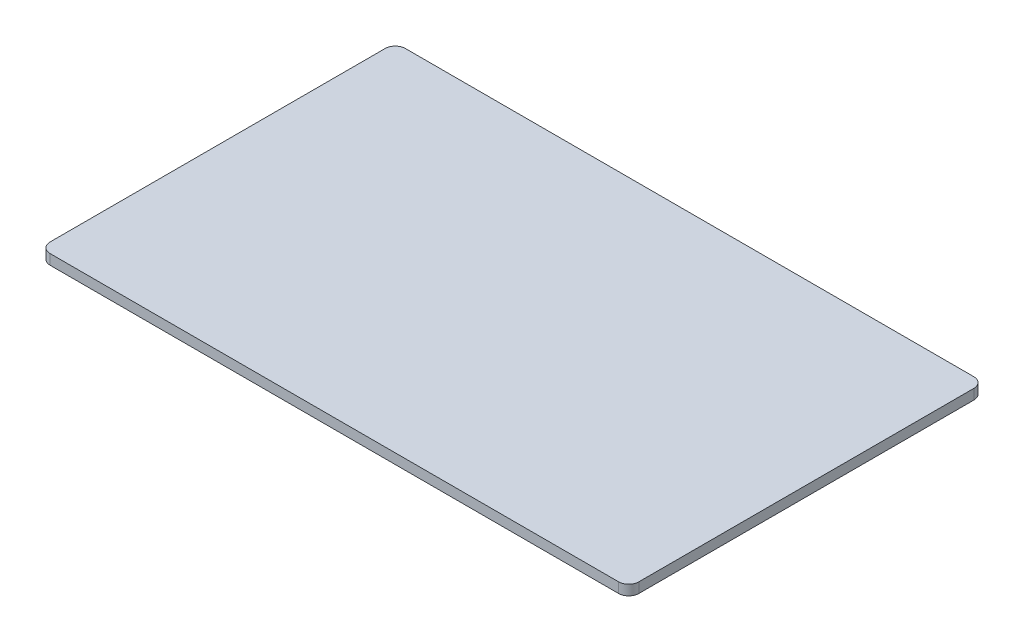
ISO-10303-21;
HEADER;
FILE_DESCRIPTION(('STEP AP214'),'2;1');
FILE_NAME('part.step','',(''),(''),'','','');
FILE_SCHEMA(('AUTOMOTIVE_DESIGN { 1 0 10303 214 1 1 1 1 }'));
ENDSEC;
DATA;
#1=APPLICATION_CONTEXT('core data for automotive mechanical design processes');
#2=APPLICATION_PROTOCOL_DEFINITION('international standard','automotive_design',2000,#1);
#3=PRODUCT_CONTEXT('',#1,'mechanical');
#4=PRODUCT('Part','Part','',(#3));
#5=PRODUCT_RELATED_PRODUCT_CATEGORY('part','',(#4));
#6=PRODUCT_DEFINITION_FORMATION('','',#4);
#7=PRODUCT_DEFINITION_CONTEXT('part definition',#1,'design');
#8=PRODUCT_DEFINITION('design','',#6,#7);
#9=PRODUCT_DEFINITION_SHAPE('','',#8);
#10=(LENGTH_UNIT() NAMED_UNIT(*) SI_UNIT(.MILLI.,.METRE.));
#11=(NAMED_UNIT(*) PLANE_ANGLE_UNIT() SI_UNIT($,.RADIAN.));
#12=(NAMED_UNIT(*) SI_UNIT($,.STERADIAN.) SOLID_ANGLE_UNIT());
#13=UNCERTAINTY_MEASURE_WITH_UNIT(LENGTH_MEASURE(1.E-05),#10,'distance_accuracy_value','');
#14=(GEOMETRIC_REPRESENTATION_CONTEXT(3) GLOBAL_UNCERTAINTY_ASSIGNED_CONTEXT((#13)) GLOBAL_UNIT_ASSIGNED_CONTEXT((#10,
#11,#12)) REPRESENTATION_CONTEXT('',''));
#15=CARTESIAN_POINT('',(0.,0.,0.));
#16=DIRECTION('',(0.,0.,1.));
#17=DIRECTION('',(1.,0.,0.));
#18=AXIS2_PLACEMENT_3D('',#15,#16,#17);
#19=CARTESIAN_POINT('',(-73.66,2.54,88.9));
#20=DIRECTION('',(0.,0.,-1.));
#21=DIRECTION('',(-1.,0.,0.));
#22=AXIS2_PLACEMENT_3D('',#19,#20,#21);
#23=PLANE('',#22);
#24=DIRECTION('',(1.,0.,0.));
#25=VECTOR('',#24,1.);
#26=CARTESIAN_POINT('',(-73.66,2.54,88.9));
#27=LINE('',#26,#25);
#28=CARTESIAN_POINT('',(-71.12,2.54,88.9));
#29=VERTEX_POINT('',#28);
#30=CARTESIAN_POINT('',(71.12,2.54,88.9));
#31=VERTEX_POINT('',#30);
#32=EDGE_CURVE('E134',#29,#31,#27,.T.);
#33=ORIENTED_EDGE('',*,*,#32,.F.);
#34=DIRECTION('',(0.,-1.,0.));
#35=VECTOR('',#34,1.);
#36=CARTESIAN_POINT('',(-71.12,0.,88.9));
#37=LINE('',#36,#35);
#38=CARTESIAN_POINT('',(-71.12,0.,88.9));
#39=VERTEX_POINT('',#38);
#40=EDGE_CURVE('E177',#29,#39,#37,.T.);
#41=ORIENTED_EDGE('',*,*,#40,.T.);
#42=DIRECTION('',(1.,0.,0.));
#43=VECTOR('',#42,1.);
#44=CARTESIAN_POINT('',(-73.66,0.,88.9));
#45=LINE('',#44,#43);
#46=CARTESIAN_POINT('',(71.12,0.,88.9));
#47=VERTEX_POINT('',#46);
#48=EDGE_CURVE('E116',#39,#47,#45,.T.);
#49=ORIENTED_EDGE('',*,*,#48,.T.);
#50=DIRECTION('',(0.,-1.,0.));
#51=VECTOR('',#50,1.);
#52=CARTESIAN_POINT('',(71.12,2.54,88.9));
#53=LINE('',#52,#51);
#54=EDGE_CURVE('E174',#47,#31,#53,.F.);
#55=ORIENTED_EDGE('',*,*,#54,.T.);
#56=EDGE_LOOP('',(#33,#41,#49,#55));
#57=FACE_BOUND('',#56,.T.);
#58=ADVANCED_FACE('F44',(#57),#23,.F.);
#59=CARTESIAN_POINT('',(73.66,2.54,0.));
#60=DIRECTION('',(1.,0.,0.));
#61=DIRECTION('',(0.,0.,-1.));
#62=AXIS2_PLACEMENT_3D('',#59,#60,#61);
#63=PLANE('',#62);
#64=DIRECTION('',(0.,0.,1.));
#65=VECTOR('',#64,1.);
#66=CARTESIAN_POINT('',(73.66,2.54,0.));
#67=LINE('',#66,#65);
#68=CARTESIAN_POINT('',(73.66,2.54,2.53999999999997));
#69=VERTEX_POINT('',#68);
#70=CARTESIAN_POINT('',(73.66,2.54,86.36));
#71=VERTEX_POINT('',#70);
#72=EDGE_CURVE('E184',#69,#71,#67,.T.);
#73=ORIENTED_EDGE('',*,*,#72,.T.);
#74=DIRECTION('',(0.,-1.,0.));
#75=VECTOR('',#74,1.);
#76=CARTESIAN_POINT('',(73.66,0.,86.36));
#77=LINE('',#76,#75);
#78=CARTESIAN_POINT('',(73.66,0.,86.36));
#79=VERTEX_POINT('',#78);
#80=EDGE_CURVE('E11',#71,#79,#77,.T.);
#81=ORIENTED_EDGE('',*,*,#80,.T.);
#82=DIRECTION('',(0.,0.,1.));
#83=VECTOR('',#82,1.);
#84=CARTESIAN_POINT('',(73.66,0.,0.));
#85=LINE('',#84,#83);
#86=CARTESIAN_POINT('',(73.66,0.,2.53999999999997));
#87=VERTEX_POINT('',#86);
#88=EDGE_CURVE('E194',#87,#79,#85,.T.);
#89=ORIENTED_EDGE('',*,*,#88,.F.);
#90=DIRECTION('',(0.,-1.,0.));
#91=VECTOR('',#90,1.);
#92=CARTESIAN_POINT('',(73.66,2.54,2.53999999999997));
#93=LINE('',#92,#91);
#94=EDGE_CURVE('E53',#87,#69,#93,.F.);
#95=ORIENTED_EDGE('',*,*,#94,.T.);
#96=EDGE_LOOP('',(#73,#81,#89,#95));
#97=FACE_BOUND('',#96,.T.);
#98=ADVANCED_FACE('F218',(#97),#63,.T.);
#99=CARTESIAN_POINT('',(-73.66,2.54,0.));
#100=DIRECTION('',(0.,0.,-1.));
#101=DIRECTION('',(-1.,0.,0.));
#102=AXIS2_PLACEMENT_3D('',#99,#100,#101);
#103=PLANE('',#102);
#104=DIRECTION('',(1.,0.,0.));
#105=VECTOR('',#104,1.);
#106=CARTESIAN_POINT('',(-73.66,0.,0.));
#107=LINE('',#106,#105);
#108=CARTESIAN_POINT('',(-71.12,0.,0.));
#109=VERTEX_POINT('',#108);
#110=CARTESIAN_POINT('',(71.12,0.,0.));
#111=VERTEX_POINT('',#110);
#112=EDGE_CURVE('E135',#109,#111,#107,.T.);
#113=ORIENTED_EDGE('',*,*,#112,.F.);
#114=DIRECTION('',(0.,-1.,0.));
#115=VECTOR('',#114,1.);
#116=CARTESIAN_POINT('',(-71.12,2.54,0.));
#117=LINE('',#116,#115);
#118=CARTESIAN_POINT('',(-71.12,2.54,0.));
#119=VERTEX_POINT('',#118);
#120=EDGE_CURVE('E161',#109,#119,#117,.F.);
#121=ORIENTED_EDGE('',*,*,#120,.T.);
#122=DIRECTION('',(1.,0.,0.));
#123=VECTOR('',#122,1.);
#124=CARTESIAN_POINT('',(-73.66,2.54,0.));
#125=LINE('',#124,#123);
#126=CARTESIAN_POINT('',(71.12,2.54,0.));
#127=VERTEX_POINT('',#126);
#128=EDGE_CURVE('E147',#119,#127,#125,.T.);
#129=ORIENTED_EDGE('',*,*,#128,.T.);
#130=DIRECTION('',(0.,-1.,0.));
#131=VECTOR('',#130,1.);
#132=CARTESIAN_POINT('',(71.12,2.54,0.));
#133=LINE('',#132,#131);
#134=EDGE_CURVE('E157',#127,#111,#133,.T.);
#135=ORIENTED_EDGE('',*,*,#134,.T.);
#136=EDGE_LOOP('',(#113,#121,#129,#135));
#137=FACE_BOUND('',#136,.T.);
#138=ADVANCED_FACE('F202',(#137),#103,.T.);
#139=CARTESIAN_POINT('',(-73.66,2.54,88.9));
#140=DIRECTION('',(-1.,0.,0.));
#141=DIRECTION('',(0.,0.,1.));
#142=AXIS2_PLACEMENT_3D('',#139,#140,#141);
#143=PLANE('',#142);
#144=DIRECTION('',(0.,0.,-1.));
#145=VECTOR('',#144,1.);
#146=CARTESIAN_POINT('',(-73.66,2.54,88.9));
#147=LINE('',#146,#145);
#148=CARTESIAN_POINT('',(-73.66,2.54,86.36));
#149=VERTEX_POINT('',#148);
#150=CARTESIAN_POINT('',(-73.66,2.54,2.54));
#151=VERTEX_POINT('',#150);
#152=EDGE_CURVE('E141',#149,#151,#147,.T.);
#153=ORIENTED_EDGE('',*,*,#152,.T.);
#154=DIRECTION('',(0.,-1.,0.));
#155=VECTOR('',#154,1.);
#156=CARTESIAN_POINT('',(-73.66,2.54,2.54));
#157=LINE('',#156,#155);
#158=CARTESIAN_POINT('',(-73.66,0.,2.54));
#159=VERTEX_POINT('',#158);
#160=EDGE_CURVE('E132',#151,#159,#157,.T.);
#161=ORIENTED_EDGE('',*,*,#160,.T.);
#162=DIRECTION('',(0.,0.,-1.));
#163=VECTOR('',#162,1.);
#164=CARTESIAN_POINT('',(-73.66,0.,88.9));
#165=LINE('',#164,#163);
#166=CARTESIAN_POINT('',(-73.66,0.,86.36));
#167=VERTEX_POINT('',#166);
#168=EDGE_CURVE('E114',#167,#159,#165,.T.);
#169=ORIENTED_EDGE('',*,*,#168,.F.);
#170=DIRECTION('',(0.,-1.,0.));
#171=VECTOR('',#170,1.);
#172=CARTESIAN_POINT('',(-73.66,2.54,86.36));
#173=LINE('',#172,#171);
#174=EDGE_CURVE('E129',#167,#149,#173,.F.);
#175=ORIENTED_EDGE('',*,*,#174,.T.);
#176=EDGE_LOOP('',(#153,#161,#169,#175));
#177=FACE_BOUND('',#176,.T.);
#178=ADVANCED_FACE('F128',(#177),#143,.T.);
#179=CARTESIAN_POINT('',(0.,2.54,0.));
#180=DIRECTION('',(0.,-1.,0.));
#181=DIRECTION('',(-1.,0.,0.));
#182=AXIS2_PLACEMENT_3D('',#179,#180,#181);
#183=PLANE('',#182);
#184=ORIENTED_EDGE('',*,*,#128,.F.);
#185=CARTESIAN_POINT('',(-71.12,2.54,2.54));
#186=DIRECTION('',(0.,-1.,0.));
#187=DIRECTION('',(0.,0.,-1.));
#188=AXIS2_PLACEMENT_3D('',#185,#186,#187);
#189=CIRCLE('',#188,2.54);
#190=EDGE_CURVE('E171',#119,#151,#189,.F.);
#191=ORIENTED_EDGE('',*,*,#190,.T.);
#192=ORIENTED_EDGE('',*,*,#152,.F.);
#193=CARTESIAN_POINT('',(-71.12,2.54,86.36));
#194=DIRECTION('',(0.,-1.,0.));
#195=DIRECTION('',(0.,0.,-1.));
#196=AXIS2_PLACEMENT_3D('',#193,#194,#195);
#197=CIRCLE('',#196,2.54);
#198=EDGE_CURVE('E139',#149,#29,#197,.F.);
#199=ORIENTED_EDGE('',*,*,#198,.T.);
#200=ORIENTED_EDGE('',*,*,#32,.T.);
#201=CARTESIAN_POINT('',(71.12,2.54,86.36));
#202=DIRECTION('',(0.,-1.,0.));
#203=DIRECTION('',(0.,0.,-1.));
#204=AXIS2_PLACEMENT_3D('',#201,#202,#203);
#205=CIRCLE('',#204,2.54);
#206=EDGE_CURVE('E60',#31,#71,#205,.F.);
#207=ORIENTED_EDGE('',*,*,#206,.T.);
#208=ORIENTED_EDGE('',*,*,#72,.F.);
#209=CARTESIAN_POINT('',(71.12,2.54,2.53999999999997));
#210=DIRECTION('',(0.,-1.,0.));
#211=DIRECTION('',(0.,0.,-1.));
#212=AXIS2_PLACEMENT_3D('',#209,#210,#211);
#213=CIRCLE('',#212,2.54);
#214=EDGE_CURVE('E164',#69,#127,#213,.F.);
#215=ORIENTED_EDGE('',*,*,#214,.T.);
#216=EDGE_LOOP('',(#184,#191,#192,#199,#200,#207,#208,#215));
#217=FACE_BOUND('',#216,.T.);
#218=ADVANCED_FACE('F208',(#217),#183,.F.);
#219=CARTESIAN_POINT('',(0.,0.,0.));
#220=DIRECTION('',(0.,-1.,0.));
#221=DIRECTION('',(-1.,0.,0.));
#222=AXIS2_PLACEMENT_3D('',#219,#220,#221);
#223=PLANE('',#222);
#224=ORIENTED_EDGE('',*,*,#168,.T.);
#225=CARTESIAN_POINT('',(-71.12,0.,2.54));
#226=DIRECTION('',(0.,-1.,0.));
#227=DIRECTION('',(0.,0.,-1.));
#228=AXIS2_PLACEMENT_3D('',#225,#226,#227);
#229=CIRCLE('',#228,2.54);
#230=EDGE_CURVE('E122',#159,#109,#229,.T.);
#231=ORIENTED_EDGE('',*,*,#230,.T.);
#232=ORIENTED_EDGE('',*,*,#112,.T.);
#233=CARTESIAN_POINT('',(71.12,0.,2.53999999999997));
#234=DIRECTION('',(0.,-1.,0.));
#235=DIRECTION('',(0.,0.,-1.));
#236=AXIS2_PLACEMENT_3D('',#233,#234,#235);
#237=CIRCLE('',#236,2.54);
#238=EDGE_CURVE('E145',#111,#87,#237,.T.);
#239=ORIENTED_EDGE('',*,*,#238,.T.);
#240=ORIENTED_EDGE('',*,*,#88,.T.);
#241=CARTESIAN_POINT('',(71.12,0.,86.36));
#242=DIRECTION('',(0.,-1.,0.));
#243=DIRECTION('',(0.,0.,-1.));
#244=AXIS2_PLACEMENT_3D('',#241,#242,#243);
#245=CIRCLE('',#244,2.54);
#246=EDGE_CURVE('E123',#79,#47,#245,.T.);
#247=ORIENTED_EDGE('',*,*,#246,.T.);
#248=ORIENTED_EDGE('',*,*,#48,.F.);
#249=CARTESIAN_POINT('',(-71.12,0.,86.36));
#250=DIRECTION('',(0.,-1.,0.));
#251=DIRECTION('',(0.,0.,-1.));
#252=AXIS2_PLACEMENT_3D('',#249,#250,#251);
#253=CIRCLE('',#252,2.54);
#254=EDGE_CURVE('E111',#39,#167,#253,.T.);
#255=ORIENTED_EDGE('',*,*,#254,.T.);
#256=EDGE_LOOP('',(#224,#231,#232,#239,#240,#247,#248,#255));
#257=FACE_BOUND('',#256,.T.);
#258=ADVANCED_FACE('F113',(#257),#223,.T.);
#259=CARTESIAN_POINT('',(-71.12,2.54,2.54));
#260=DIRECTION('',(0.,-1.,0.));
#261=DIRECTION('',(0.,0.,-1.));
#262=AXIS2_PLACEMENT_3D('',#259,#260,#261);
#263=CYLINDRICAL_SURFACE('',#262,2.54);
#264=ORIENTED_EDGE('',*,*,#190,.F.);
#265=ORIENTED_EDGE('',*,*,#120,.F.);
#266=ORIENTED_EDGE('',*,*,#230,.F.);
#267=ORIENTED_EDGE('',*,*,#160,.F.);
#268=EDGE_LOOP('',(#264,#265,#266,#267));
#269=FACE_BOUND('',#268,.T.);
#270=ADVANCED_FACE('F207',(#269),#263,.T.);
#271=CARTESIAN_POINT('',(-71.12,2.54,86.36));
#272=DIRECTION('',(0.,1.,0.));
#273=DIRECTION('',(0.,0.,1.));
#274=AXIS2_PLACEMENT_3D('',#271,#272,#273);
#275=CYLINDRICAL_SURFACE('',#274,2.54);
#276=ORIENTED_EDGE('',*,*,#198,.F.);
#277=ORIENTED_EDGE('',*,*,#174,.F.);
#278=ORIENTED_EDGE('',*,*,#254,.F.);
#279=ORIENTED_EDGE('',*,*,#40,.F.);
#280=EDGE_LOOP('',(#276,#277,#278,#279));
#281=FACE_BOUND('',#280,.T.);
#282=ADVANCED_FACE('F138',(#281),#275,.T.);
#283=CARTESIAN_POINT('',(71.12,2.54,86.36));
#284=DIRECTION('',(0.,1.,0.));
#285=DIRECTION('',(0.,0.,1.));
#286=AXIS2_PLACEMENT_3D('',#283,#284,#285);
#287=CYLINDRICAL_SURFACE('',#286,2.54);
#288=ORIENTED_EDGE('',*,*,#206,.F.);
#289=ORIENTED_EDGE('',*,*,#54,.F.);
#290=ORIENTED_EDGE('',*,*,#246,.F.);
#291=ORIENTED_EDGE('',*,*,#80,.F.);
#292=EDGE_LOOP('',(#288,#289,#290,#291));
#293=FACE_BOUND('',#292,.T.);
#294=ADVANCED_FACE('F212',(#293),#287,.T.);
#295=CARTESIAN_POINT('',(71.12,2.54,2.53999999999997));
#296=DIRECTION('',(0.,-1.,0.));
#297=DIRECTION('',(0.,0.,-1.));
#298=AXIS2_PLACEMENT_3D('',#295,#296,#297);
#299=CYLINDRICAL_SURFACE('',#298,2.54);
#300=ORIENTED_EDGE('',*,*,#214,.F.);
#301=ORIENTED_EDGE('',*,*,#94,.F.);
#302=ORIENTED_EDGE('',*,*,#238,.F.);
#303=ORIENTED_EDGE('',*,*,#134,.F.);
#304=EDGE_LOOP('',(#300,#301,#302,#303));
#305=FACE_BOUND('',#304,.T.);
#306=ADVANCED_FACE('F46',(#305),#299,.T.);
#307=CLOSED_SHELL('',(#58,#98,#138,#178,#218,#258,#270,#282,#294,#306));
#308=MANIFOLD_SOLID_BREP('B2',#307);
#309=ADVANCED_BREP_SHAPE_REPRESENTATION('',(#18,#308),#14);
#310=SHAPE_DEFINITION_REPRESENTATION(#9,#309);
ENDSEC;
END-ISO-10303-21;
